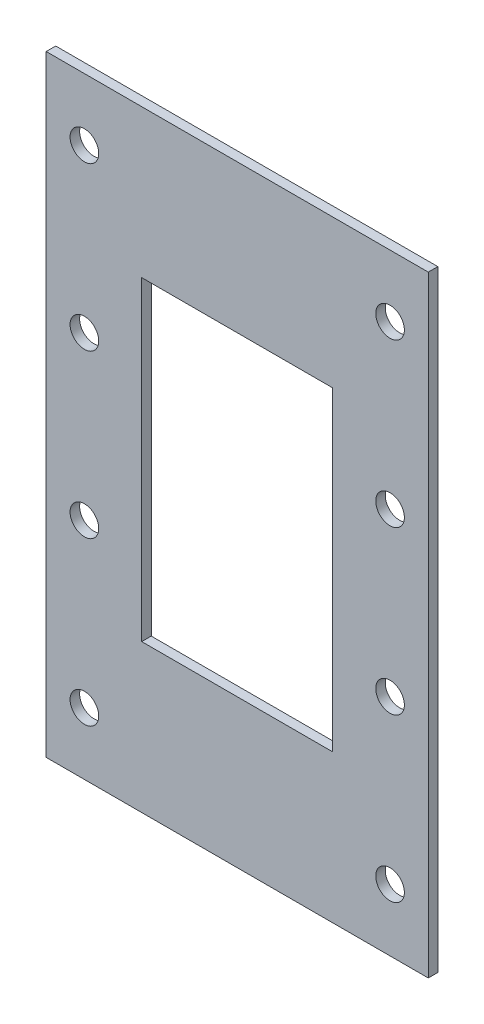
ISO-10303-21;
HEADER;
FILE_DESCRIPTION(('STEP AP214'),'2;1');
FILE_NAME('part.step','',(''),(''),'','','');
FILE_SCHEMA(('AUTOMOTIVE_DESIGN { 1 0 10303 214 1 1 1 1 }'));
ENDSEC;
DATA;
#1=APPLICATION_CONTEXT('core data for automotive mechanical design processes');
#2=APPLICATION_PROTOCOL_DEFINITION('international standard','automotive_design',2000,#1);
#3=PRODUCT_CONTEXT('',#1,'mechanical');
#4=PRODUCT('Part','Part','',(#3));
#5=PRODUCT_RELATED_PRODUCT_CATEGORY('part','',(#4));
#6=PRODUCT_DEFINITION_FORMATION('','',#4);
#7=PRODUCT_DEFINITION_CONTEXT('part definition',#1,'design');
#8=PRODUCT_DEFINITION('design','',#6,#7);
#9=PRODUCT_DEFINITION_SHAPE('','',#8);
#10=(LENGTH_UNIT() NAMED_UNIT(*) SI_UNIT(.MILLI.,.METRE.));
#11=(NAMED_UNIT(*) PLANE_ANGLE_UNIT() SI_UNIT($,.RADIAN.));
#12=(NAMED_UNIT(*) SI_UNIT($,.STERADIAN.) SOLID_ANGLE_UNIT());
#13=UNCERTAINTY_MEASURE_WITH_UNIT(LENGTH_MEASURE(1.E-05),#10,'distance_accuracy_value','');
#14=(GEOMETRIC_REPRESENTATION_CONTEXT(3) GLOBAL_UNCERTAINTY_ASSIGNED_CONTEXT((#13)) GLOBAL_UNIT_ASSIGNED_CONTEXT((#10,
#11,#12)) REPRESENTATION_CONTEXT('',''));
#15=CARTESIAN_POINT('',(0.,0.,0.));
#16=DIRECTION('',(0.,0.,1.));
#17=DIRECTION('',(1.,0.,0.));
#18=AXIS2_PLACEMENT_3D('',#15,#16,#17);
#19=CARTESIAN_POINT('',(0.,0.,1.));
#20=DIRECTION('',(0.,0.,1.));
#21=DIRECTION('',(1.,0.,0.));
#22=AXIS2_PLACEMENT_3D('',#19,#20,#21);
#23=PLANE('',#22);
#24=CARTESIAN_POINT('',(36.,31.3258575197889,1.));
#25=DIRECTION('',(0.,0.,1.));
#26=DIRECTION('',(1.,0.,0.));
#27=AXIS2_PLACEMENT_3D('',#24,#25,#26);
#28=CIRCLE('',#27,1.5);
#29=CARTESIAN_POINT('',(37.5,31.3258575197889,1.));
#30=VERTEX_POINT('',#29);
#31=EDGE_CURVE('E218',#30,#30,#28,.T.);
#32=ORIENTED_EDGE('',*,*,#31,.F.);
#33=EDGE_LOOP('',(#32));
#34=FACE_BOUND('',#33,.T.);
#35=CARTESIAN_POINT('',(36.,14.3258575197889,1.));
#36=DIRECTION('',(0.,0.,1.));
#37=DIRECTION('',(1.,0.,0.));
#38=AXIS2_PLACEMENT_3D('',#35,#36,#37);
#39=CIRCLE('',#38,1.5);
#40=CARTESIAN_POINT('',(37.5,14.3258575197889,1.));
#41=VERTEX_POINT('',#40);
#42=EDGE_CURVE('E214',#41,#41,#39,.T.);
#43=ORIENTED_EDGE('',*,*,#42,.F.);
#44=EDGE_LOOP('',(#43));
#45=FACE_BOUND('',#44,.T.);
#46=CARTESIAN_POINT('',(36.,-2.67414248021108,1.));
#47=DIRECTION('',(0.,0.,1.));
#48=DIRECTION('',(1.,0.,0.));
#49=AXIS2_PLACEMENT_3D('',#46,#47,#48);
#50=CIRCLE('',#49,1.5);
#51=CARTESIAN_POINT('',(37.5,-2.67414248021108,1.));
#52=VERTEX_POINT('',#51);
#53=EDGE_CURVE('E210',#52,#52,#50,.T.);
#54=ORIENTED_EDGE('',*,*,#53,.F.);
#55=EDGE_LOOP('',(#54));
#56=FACE_BOUND('',#55,.T.);
#57=CARTESIAN_POINT('',(36.,-19.6741424802111,1.));
#58=DIRECTION('',(0.,0.,1.));
#59=DIRECTION('',(1.,0.,0.));
#60=AXIS2_PLACEMENT_3D('',#57,#58,#59);
#61=CIRCLE('',#60,1.5);
#62=CARTESIAN_POINT('',(37.5,-19.6741424802111,1.));
#63=VERTEX_POINT('',#62);
#64=EDGE_CURVE('E206',#63,#63,#61,.T.);
#65=ORIENTED_EDGE('',*,*,#64,.F.);
#66=EDGE_LOOP('',(#65));
#67=FACE_BOUND('',#66,.T.);
#68=CARTESIAN_POINT('',(4.00000000000001,-19.6741424802111,1.));
#69=DIRECTION('',(0.,0.,1.));
#70=DIRECTION('',(1.,0.,0.));
#71=AXIS2_PLACEMENT_3D('',#68,#69,#70);
#72=CIRCLE('',#71,1.5);
#73=CARTESIAN_POINT('',(5.50000000000001,-19.6741424802111,1.));
#74=VERTEX_POINT('',#73);
#75=EDGE_CURVE('E202',#74,#74,#72,.T.);
#76=ORIENTED_EDGE('',*,*,#75,.F.);
#77=EDGE_LOOP('',(#76));
#78=FACE_BOUND('',#77,.T.);
#79=CARTESIAN_POINT('',(4.,-2.67414248021108,1.));
#80=DIRECTION('',(0.,0.,1.));
#81=DIRECTION('',(1.,0.,0.));
#82=AXIS2_PLACEMENT_3D('',#79,#80,#81);
#83=CIRCLE('',#82,1.5);
#84=CARTESIAN_POINT('',(5.5,-2.67414248021108,1.));
#85=VERTEX_POINT('',#84);
#86=EDGE_CURVE('E198',#85,#85,#83,.T.);
#87=ORIENTED_EDGE('',*,*,#86,.F.);
#88=EDGE_LOOP('',(#87));
#89=FACE_BOUND('',#88,.T.);
#90=CARTESIAN_POINT('',(4.,14.3258575197889,1.));
#91=DIRECTION('',(0.,0.,1.));
#92=DIRECTION('',(1.,0.,0.));
#93=AXIS2_PLACEMENT_3D('',#90,#91,#92);
#94=CIRCLE('',#93,1.5);
#95=CARTESIAN_POINT('',(5.5,14.3258575197889,1.));
#96=VERTEX_POINT('',#95);
#97=EDGE_CURVE('E194',#96,#96,#94,.T.);
#98=ORIENTED_EDGE('',*,*,#97,.F.);
#99=EDGE_LOOP('',(#98));
#100=FACE_BOUND('',#99,.T.);
#101=CARTESIAN_POINT('',(4.,31.3258575197889,1.));
#102=DIRECTION('',(0.,0.,1.));
#103=DIRECTION('',(1.,0.,0.));
#104=AXIS2_PLACEMENT_3D('',#101,#102,#103);
#105=CIRCLE('',#104,1.5);
#106=CARTESIAN_POINT('',(5.5,31.3258575197889,1.));
#107=VERTEX_POINT('',#106);
#108=EDGE_CURVE('E190',#107,#107,#105,.T.);
#109=ORIENTED_EDGE('',*,*,#108,.F.);
#110=EDGE_LOOP('',(#109));
#111=FACE_BOUND('',#110,.T.);
#112=DIRECTION('',(0.,-1.,0.));
#113=VECTOR('',#112,1.);
#114=CARTESIAN_POINT('',(0.,37.8258575197889,1.));
#115=LINE('',#114,#113);
#116=CARTESIAN_POINT('',(0.,37.8258575197889,1.));
#117=VERTEX_POINT('',#116);
#118=CARTESIAN_POINT('',(0.,-26.1741424802111,1.));
#119=VERTEX_POINT('',#118);
#120=EDGE_CURVE('E223',#117,#119,#115,.T.);
#121=ORIENTED_EDGE('',*,*,#120,.T.);
#122=DIRECTION('',(1.,0.,0.));
#123=VECTOR('',#122,1.);
#124=CARTESIAN_POINT('',(0.,-26.1741424802111,1.));
#125=LINE('',#124,#123);
#126=CARTESIAN_POINT('',(40.,-26.1741424802111,1.));
#127=VERTEX_POINT('',#126);
#128=EDGE_CURVE('E227',#119,#127,#125,.T.);
#129=ORIENTED_EDGE('',*,*,#128,.T.);
#130=DIRECTION('',(0.,1.,0.));
#131=VECTOR('',#130,1.);
#132=CARTESIAN_POINT('',(40.,37.8258575197889,1.));
#133=LINE('',#132,#131);
#134=CARTESIAN_POINT('',(40.,37.8258575197889,1.));
#135=VERTEX_POINT('',#134);
#136=EDGE_CURVE('E231',#127,#135,#133,.T.);
#137=ORIENTED_EDGE('',*,*,#136,.T.);
#138=DIRECTION('',(-1.,0.,0.));
#139=VECTOR('',#138,1.);
#140=CARTESIAN_POINT('',(0.,37.8258575197889,1.));
#141=LINE('',#140,#139);
#142=EDGE_CURVE('E234',#135,#117,#141,.T.);
#143=ORIENTED_EDGE('',*,*,#142,.T.);
#144=EDGE_LOOP('',(#121,#129,#137,#143));
#145=FACE_BOUND('',#144,.T.);
#146=DIRECTION('',(1.,0.,0.));
#147=VECTOR('',#146,1.);
#148=CARTESIAN_POINT('',(0.,22.3258575197889,1.));
#149=LINE('',#148,#147);
#150=CARTESIAN_POINT('',(10.,22.3258575197889,1.));
#151=VERTEX_POINT('',#150);
#152=CARTESIAN_POINT('',(30.,22.3258575197889,1.));
#153=VERTEX_POINT('',#152);
#154=EDGE_CURVE('E173',#151,#153,#149,.T.);
#155=ORIENTED_EDGE('',*,*,#154,.T.);
#156=DIRECTION('',(0.,-1.,0.));
#157=VECTOR('',#156,1.);
#158=CARTESIAN_POINT('',(30.,0.,1.));
#159=LINE('',#158,#157);
#160=CARTESIAN_POINT('',(30.,-10.6741424802111,1.));
#161=VERTEX_POINT('',#160);
#162=EDGE_CURVE('E147',#153,#161,#159,.T.);
#163=ORIENTED_EDGE('',*,*,#162,.T.);
#164=DIRECTION('',(1.,0.,0.));
#165=VECTOR('',#164,1.);
#166=CARTESIAN_POINT('',(0.,-10.6741424802111,1.));
#167=LINE('',#166,#165);
#168=CARTESIAN_POINT('',(10.,-10.6741424802111,1.));
#169=VERTEX_POINT('',#168);
#170=EDGE_CURVE('E185',#169,#161,#167,.T.);
#171=ORIENTED_EDGE('',*,*,#170,.F.);
#172=DIRECTION('',(0.,-1.,0.));
#173=VECTOR('',#172,1.);
#174=CARTESIAN_POINT('',(10.,0.,1.));
#175=LINE('',#174,#173);
#176=EDGE_CURVE('E182',#151,#169,#175,.T.);
#177=ORIENTED_EDGE('',*,*,#176,.F.);
#178=EDGE_LOOP('',(#155,#163,#171,#177));
#179=FACE_BOUND('',#178,.T.);
#180=ADVANCED_FACE('F69',(#34,#45,#56,#67,#78,#89,#100,#111,#145,#179),#23,.T.);
#181=CARTESIAN_POINT('',(0.,0.,0.));
#182=DIRECTION('',(0.,0.,1.));
#183=DIRECTION('',(1.,0.,0.));
#184=AXIS2_PLACEMENT_3D('',#181,#182,#183);
#185=PLANE('',#184);
#186=CARTESIAN_POINT('',(36.,31.3258575197889,0.));
#187=DIRECTION('',(0.,0.,1.));
#188=DIRECTION('',(1.,0.,0.));
#189=AXIS2_PLACEMENT_3D('',#186,#187,#188);
#190=CIRCLE('',#189,1.5);
#191=CARTESIAN_POINT('',(37.5,31.3258575197889,0.));
#192=VERTEX_POINT('',#191);
#193=EDGE_CURVE('E163',#192,#192,#190,.T.);
#194=ORIENTED_EDGE('',*,*,#193,.T.);
#195=EDGE_LOOP('',(#194));
#196=FACE_BOUND('',#195,.T.);
#197=CARTESIAN_POINT('',(36.,14.3258575197889,0.));
#198=DIRECTION('',(0.,0.,1.));
#199=DIRECTION('',(1.,0.,0.));
#200=AXIS2_PLACEMENT_3D('',#197,#198,#199);
#201=CIRCLE('',#200,1.5);
#202=CARTESIAN_POINT('',(37.5,14.3258575197889,0.));
#203=VERTEX_POINT('',#202);
#204=EDGE_CURVE('E355',#203,#203,#201,.T.);
#205=ORIENTED_EDGE('',*,*,#204,.T.);
#206=EDGE_LOOP('',(#205));
#207=FACE_BOUND('',#206,.T.);
#208=CARTESIAN_POINT('',(36.,-2.67414248021108,0.));
#209=DIRECTION('',(0.,0.,1.));
#210=DIRECTION('',(1.,0.,0.));
#211=AXIS2_PLACEMENT_3D('',#208,#209,#210);
#212=CIRCLE('',#211,1.5);
#213=CARTESIAN_POINT('',(37.5,-2.67414248021108,0.));
#214=VERTEX_POINT('',#213);
#215=EDGE_CURVE('E358',#214,#214,#212,.T.);
#216=ORIENTED_EDGE('',*,*,#215,.T.);
#217=EDGE_LOOP('',(#216));
#218=FACE_BOUND('',#217,.T.);
#219=CARTESIAN_POINT('',(36.,-19.6741424802111,0.));
#220=DIRECTION('',(0.,0.,1.));
#221=DIRECTION('',(1.,0.,0.));
#222=AXIS2_PLACEMENT_3D('',#219,#220,#221);
#223=CIRCLE('',#222,1.5);
#224=CARTESIAN_POINT('',(37.5,-19.6741424802111,0.));
#225=VERTEX_POINT('',#224);
#226=EDGE_CURVE('E362',#225,#225,#223,.T.);
#227=ORIENTED_EDGE('',*,*,#226,.T.);
#228=EDGE_LOOP('',(#227));
#229=FACE_BOUND('',#228,.T.);
#230=CARTESIAN_POINT('',(4.00000000000001,-19.6741424802111,0.));
#231=DIRECTION('',(0.,0.,1.));
#232=DIRECTION('',(1.,0.,0.));
#233=AXIS2_PLACEMENT_3D('',#230,#231,#232);
#234=CIRCLE('',#233,1.5);
#235=CARTESIAN_POINT('',(5.50000000000001,-19.6741424802111,0.));
#236=VERTEX_POINT('',#235);
#237=EDGE_CURVE('E369',#236,#236,#234,.T.);
#238=ORIENTED_EDGE('',*,*,#237,.T.);
#239=EDGE_LOOP('',(#238));
#240=FACE_BOUND('',#239,.T.);
#241=CARTESIAN_POINT('',(4.,-2.67414248021108,0.));
#242=DIRECTION('',(0.,0.,1.));
#243=DIRECTION('',(1.,0.,0.));
#244=AXIS2_PLACEMENT_3D('',#241,#242,#243);
#245=CIRCLE('',#244,1.5);
#246=CARTESIAN_POINT('',(5.5,-2.67414248021108,0.));
#247=VERTEX_POINT('',#246);
#248=EDGE_CURVE('E373',#247,#247,#245,.T.);
#249=ORIENTED_EDGE('',*,*,#248,.T.);
#250=EDGE_LOOP('',(#249));
#251=FACE_BOUND('',#250,.T.);
#252=CARTESIAN_POINT('',(4.,14.3258575197889,0.));
#253=DIRECTION('',(0.,0.,1.));
#254=DIRECTION('',(1.,0.,0.));
#255=AXIS2_PLACEMENT_3D('',#252,#253,#254);
#256=CIRCLE('',#255,1.5);
#257=CARTESIAN_POINT('',(5.5,14.3258575197889,0.));
#258=VERTEX_POINT('',#257);
#259=EDGE_CURVE('E160',#258,#258,#256,.T.);
#260=ORIENTED_EDGE('',*,*,#259,.T.);
#261=EDGE_LOOP('',(#260));
#262=FACE_BOUND('',#261,.T.);
#263=CARTESIAN_POINT('',(4.,31.3258575197889,0.));
#264=DIRECTION('',(0.,0.,1.));
#265=DIRECTION('',(1.,0.,0.));
#266=AXIS2_PLACEMENT_3D('',#263,#264,#265);
#267=CIRCLE('',#266,1.5);
#268=CARTESIAN_POINT('',(5.5,31.3258575197889,0.));
#269=VERTEX_POINT('',#268);
#270=EDGE_CURVE('E156',#269,#269,#267,.T.);
#271=ORIENTED_EDGE('',*,*,#270,.T.);
#272=EDGE_LOOP('',(#271));
#273=FACE_BOUND('',#272,.T.);
#274=DIRECTION('',(0.,-1.,0.));
#275=VECTOR('',#274,1.);
#276=CARTESIAN_POINT('',(0.,37.8258575197889,0.));
#277=LINE('',#276,#275);
#278=CARTESIAN_POINT('',(0.,37.8258575197889,0.));
#279=VERTEX_POINT('',#278);
#280=CARTESIAN_POINT('',(0.,-26.1741424802111,0.));
#281=VERTEX_POINT('',#280);
#282=EDGE_CURVE('E222',#279,#281,#277,.T.);
#283=ORIENTED_EDGE('',*,*,#282,.F.);
#284=DIRECTION('',(-1.,0.,0.));
#285=VECTOR('',#284,1.);
#286=CARTESIAN_POINT('',(0.,37.8258575197889,0.));
#287=LINE('',#286,#285);
#288=CARTESIAN_POINT('',(40.,37.8258575197889,0.));
#289=VERTEX_POINT('',#288);
#290=EDGE_CURVE('E228',#289,#279,#287,.T.);
#291=ORIENTED_EDGE('',*,*,#290,.F.);
#292=DIRECTION('',(0.,1.,0.));
#293=VECTOR('',#292,1.);
#294=CARTESIAN_POINT('',(40.,37.8258575197889,0.));
#295=LINE('',#294,#293);
#296=CARTESIAN_POINT('',(40.,-26.1741424802111,0.));
#297=VERTEX_POINT('',#296);
#298=EDGE_CURVE('E244',#297,#289,#295,.T.);
#299=ORIENTED_EDGE('',*,*,#298,.F.);
#300=DIRECTION('',(1.,0.,0.));
#301=VECTOR('',#300,1.);
#302=CARTESIAN_POINT('',(0.,-26.1741424802111,0.));
#303=LINE('',#302,#301);
#304=EDGE_CURVE('E241',#281,#297,#303,.T.);
#305=ORIENTED_EDGE('',*,*,#304,.F.);
#306=EDGE_LOOP('',(#283,#291,#299,#305));
#307=FACE_BOUND('',#306,.T.);
#308=DIRECTION('',(0.,-1.,0.));
#309=VECTOR('',#308,1.);
#310=CARTESIAN_POINT('',(30.,0.,0.));
#311=LINE('',#310,#309);
#312=CARTESIAN_POINT('',(30.,22.3258575197889,0.));
#313=VERTEX_POINT('',#312);
#314=CARTESIAN_POINT('',(30.,-10.6741424802111,0.));
#315=VERTEX_POINT('',#314);
#316=EDGE_CURVE('E140',#313,#315,#311,.T.);
#317=ORIENTED_EDGE('',*,*,#316,.F.);
#318=DIRECTION('',(1.,0.,0.));
#319=VECTOR('',#318,1.);
#320=CARTESIAN_POINT('',(0.,22.3258575197889,0.));
#321=LINE('',#320,#319);
#322=CARTESIAN_POINT('',(10.,22.3258575197889,0.));
#323=VERTEX_POINT('',#322);
#324=EDGE_CURVE('E134',#323,#313,#321,.T.);
#325=ORIENTED_EDGE('',*,*,#324,.F.);
#326=DIRECTION('',(0.,-1.,0.));
#327=VECTOR('',#326,1.);
#328=CARTESIAN_POINT('',(10.,0.,0.));
#329=LINE('',#328,#327);
#330=CARTESIAN_POINT('',(10.,-10.6741424802111,0.));
#331=VERTEX_POINT('',#330);
#332=EDGE_CURVE('E93',#323,#331,#329,.T.);
#333=ORIENTED_EDGE('',*,*,#332,.T.);
#334=DIRECTION('',(1.,0.,0.));
#335=VECTOR('',#334,1.);
#336=CARTESIAN_POINT('',(0.,-10.6741424802111,0.));
#337=LINE('',#336,#335);
#338=EDGE_CURVE('E150',#331,#315,#337,.T.);
#339=ORIENTED_EDGE('',*,*,#338,.T.);
#340=EDGE_LOOP('',(#317,#325,#333,#339));
#341=FACE_BOUND('',#340,.T.);
#342=ADVANCED_FACE('F153',(#196,#207,#218,#229,#240,#251,#262,#273,#307,#341),#185,.F.);
#343=CARTESIAN_POINT('',(0.,37.8258575197889,1.));
#344=DIRECTION('',(1.,0.,0.));
#345=DIRECTION('',(0.,0.,-1.));
#346=AXIS2_PLACEMENT_3D('',#343,#344,#345);
#347=PLANE('',#346);
#348=ORIENTED_EDGE('',*,*,#282,.T.);
#349=DIRECTION('',(0.,0.,-1.));
#350=VECTOR('',#349,1.);
#351=CARTESIAN_POINT('',(0.,-26.1741424802111,1.));
#352=LINE('',#351,#350);
#353=EDGE_CURVE('E12',#119,#281,#352,.T.);
#354=ORIENTED_EDGE('',*,*,#353,.F.);
#355=ORIENTED_EDGE('',*,*,#120,.F.);
#356=DIRECTION('',(0.,0.,-1.));
#357=VECTOR('',#356,1.);
#358=CARTESIAN_POINT('',(0.,37.8258575197889,1.));
#359=LINE('',#358,#357);
#360=EDGE_CURVE('E237',#117,#279,#359,.T.);
#361=ORIENTED_EDGE('',*,*,#360,.T.);
#362=EDGE_LOOP('',(#348,#354,#355,#361));
#363=FACE_BOUND('',#362,.T.);
#364=ADVANCED_FACE('F71',(#363),#347,.F.);
#365=CARTESIAN_POINT('',(0.,-26.1741424802111,1.));
#366=DIRECTION('',(0.,1.,0.));
#367=DIRECTION('',(0.,0.,1.));
#368=AXIS2_PLACEMENT_3D('',#365,#366,#367);
#369=PLANE('',#368);
#370=ORIENTED_EDGE('',*,*,#304,.T.);
#371=DIRECTION('',(0.,0.,-1.));
#372=VECTOR('',#371,1.);
#373=CARTESIAN_POINT('',(40.,-26.1741424802111,1.));
#374=LINE('',#373,#372);
#375=EDGE_CURVE('E78',#127,#297,#374,.T.);
#376=ORIENTED_EDGE('',*,*,#375,.F.);
#377=ORIENTED_EDGE('',*,*,#128,.F.);
#378=ORIENTED_EDGE('',*,*,#353,.T.);
#379=EDGE_LOOP('',(#370,#376,#377,#378));
#380=FACE_BOUND('',#379,.T.);
#381=ADVANCED_FACE('F276',(#380),#369,.F.);
#382=CARTESIAN_POINT('',(40.,37.8258575197889,1.));
#383=DIRECTION('',(-1.,0.,0.));
#384=DIRECTION('',(0.,-1.,0.));
#385=AXIS2_PLACEMENT_3D('',#382,#383,#384);
#386=PLANE('',#385);
#387=ORIENTED_EDGE('',*,*,#298,.T.);
#388=DIRECTION('',(0.,0.,-1.));
#389=VECTOR('',#388,1.);
#390=CARTESIAN_POINT('',(40.,37.8258575197889,1.));
#391=LINE('',#390,#389);
#392=EDGE_CURVE('E252',#135,#289,#391,.T.);
#393=ORIENTED_EDGE('',*,*,#392,.F.);
#394=ORIENTED_EDGE('',*,*,#136,.F.);
#395=ORIENTED_EDGE('',*,*,#375,.T.);
#396=EDGE_LOOP('',(#387,#393,#394,#395));
#397=FACE_BOUND('',#396,.T.);
#398=ADVANCED_FACE('F261',(#397),#386,.F.);
#399=CARTESIAN_POINT('',(0.,37.8258575197889,1.));
#400=DIRECTION('',(0.,-1.,0.));
#401=DIRECTION('',(0.,0.,-1.));
#402=AXIS2_PLACEMENT_3D('',#399,#400,#401);
#403=PLANE('',#402);
#404=ORIENTED_EDGE('',*,*,#290,.T.);
#405=ORIENTED_EDGE('',*,*,#360,.F.);
#406=ORIENTED_EDGE('',*,*,#142,.F.);
#407=ORIENTED_EDGE('',*,*,#392,.T.);
#408=EDGE_LOOP('',(#404,#405,#406,#407));
#409=FACE_BOUND('',#408,.T.);
#410=ADVANCED_FACE('F269',(#409),#403,.F.);
#411=CARTESIAN_POINT('',(30.,0.,0.));
#412=DIRECTION('',(-1.,0.,0.));
#413=DIRECTION('',(0.,-1.,0.));
#414=AXIS2_PLACEMENT_3D('',#411,#412,#413);
#415=PLANE('',#414);
#416=DIRECTION('',(0.,0.,1.));
#417=VECTOR('',#416,1.);
#418=CARTESIAN_POINT('',(30.,22.3258575197889,0.));
#419=LINE('',#418,#417);
#420=EDGE_CURVE('E85',#313,#153,#419,.T.);
#421=ORIENTED_EDGE('',*,*,#420,.F.);
#422=ORIENTED_EDGE('',*,*,#316,.T.);
#423=DIRECTION('',(0.,0.,1.));
#424=VECTOR('',#423,1.);
#425=CARTESIAN_POINT('',(30.,-10.6741424802111,0.));
#426=LINE('',#425,#424);
#427=EDGE_CURVE('E170',#315,#161,#426,.T.);
#428=ORIENTED_EDGE('',*,*,#427,.T.);
#429=ORIENTED_EDGE('',*,*,#162,.F.);
#430=EDGE_LOOP('',(#421,#422,#428,#429));
#431=FACE_BOUND('',#430,.T.);
#432=ADVANCED_FACE('F143',(#431),#415,.T.);
#433=CARTESIAN_POINT('',(0.,-10.6741424802111,0.));
#434=DIRECTION('',(0.,-1.,0.));
#435=DIRECTION('',(1.,0.,0.));
#436=AXIS2_PLACEMENT_3D('',#433,#434,#435);
#437=PLANE('',#436);
#438=ORIENTED_EDGE('',*,*,#170,.T.);
#439=ORIENTED_EDGE('',*,*,#427,.F.);
#440=ORIENTED_EDGE('',*,*,#338,.F.);
#441=DIRECTION('',(0.,0.,1.));
#442=VECTOR('',#441,1.);
#443=CARTESIAN_POINT('',(10.,-10.6741424802111,0.));
#444=LINE('',#443,#442);
#445=EDGE_CURVE('E174',#331,#169,#444,.T.);
#446=ORIENTED_EDGE('',*,*,#445,.T.);
#447=EDGE_LOOP('',(#438,#439,#440,#446));
#448=FACE_BOUND('',#447,.T.);
#449=ADVANCED_FACE('F300',(#448),#437,.F.);
#450=CARTESIAN_POINT('',(10.,0.,0.));
#451=DIRECTION('',(-1.,0.,0.));
#452=DIRECTION('',(0.,-1.,0.));
#453=AXIS2_PLACEMENT_3D('',#450,#451,#452);
#454=PLANE('',#453);
#455=ORIENTED_EDGE('',*,*,#176,.T.);
#456=ORIENTED_EDGE('',*,*,#445,.F.);
#457=ORIENTED_EDGE('',*,*,#332,.F.);
#458=DIRECTION('',(0.,0.,1.));
#459=VECTOR('',#458,1.);
#460=CARTESIAN_POINT('',(10.,22.3258575197889,0.));
#461=LINE('',#460,#459);
#462=EDGE_CURVE('E136',#323,#151,#461,.T.);
#463=ORIENTED_EDGE('',*,*,#462,.T.);
#464=EDGE_LOOP('',(#455,#456,#457,#463));
#465=FACE_BOUND('',#464,.T.);
#466=ADVANCED_FACE('F304',(#465),#454,.F.);
#467=CARTESIAN_POINT('',(0.,22.3258575197889,0.));
#468=DIRECTION('',(0.,-1.,0.));
#469=DIRECTION('',(1.,0.,0.));
#470=AXIS2_PLACEMENT_3D('',#467,#468,#469);
#471=PLANE('',#470);
#472=ORIENTED_EDGE('',*,*,#462,.F.);
#473=ORIENTED_EDGE('',*,*,#324,.T.);
#474=ORIENTED_EDGE('',*,*,#420,.T.);
#475=ORIENTED_EDGE('',*,*,#154,.F.);
#476=EDGE_LOOP('',(#472,#473,#474,#475));
#477=FACE_BOUND('',#476,.T.);
#478=ADVANCED_FACE('F135',(#477),#471,.T.);
#479=CARTESIAN_POINT('',(4.,31.3258575197889,0.));
#480=DIRECTION('',(0.,0.,1.));
#481=DIRECTION('',(1.,0.,0.));
#482=AXIS2_PLACEMENT_3D('',#479,#480,#481);
#483=CYLINDRICAL_SURFACE('',#482,1.5);
#484=ORIENTED_EDGE('',*,*,#108,.T.);
#485=EDGE_LOOP('',(#484));
#486=FACE_BOUND('',#485,.T.);
#487=ORIENTED_EDGE('',*,*,#270,.F.);
#488=EDGE_LOOP('',(#487));
#489=FACE_BOUND('',#488,.T.);
#490=ADVANCED_FACE('F315',(#486,#489),#483,.F.);
#491=CARTESIAN_POINT('',(4.,14.3258575197889,0.));
#492=DIRECTION('',(0.,0.,1.));
#493=DIRECTION('',(1.,0.,0.));
#494=AXIS2_PLACEMENT_3D('',#491,#492,#493);
#495=CYLINDRICAL_SURFACE('',#494,1.5);
#496=ORIENTED_EDGE('',*,*,#97,.T.);
#497=EDGE_LOOP('',(#496));
#498=FACE_BOUND('',#497,.T.);
#499=ORIENTED_EDGE('',*,*,#259,.F.);
#500=EDGE_LOOP('',(#499));
#501=FACE_BOUND('',#500,.T.);
#502=ADVANCED_FACE('F319',(#498,#501),#495,.F.);
#503=CARTESIAN_POINT('',(4.,-2.67414248021108,0.));
#504=DIRECTION('',(0.,0.,1.));
#505=DIRECTION('',(1.,0.,0.));
#506=AXIS2_PLACEMENT_3D('',#503,#504,#505);
#507=CYLINDRICAL_SURFACE('',#506,1.5);
#508=ORIENTED_EDGE('',*,*,#86,.T.);
#509=EDGE_LOOP('',(#508));
#510=FACE_BOUND('',#509,.T.);
#511=ORIENTED_EDGE('',*,*,#248,.F.);
#512=EDGE_LOOP('',(#511));
#513=FACE_BOUND('',#512,.T.);
#514=ADVANCED_FACE('F325',(#510,#513),#507,.F.);
#515=CARTESIAN_POINT('',(4.00000000000001,-19.6741424802111,0.));
#516=DIRECTION('',(0.,0.,1.));
#517=DIRECTION('',(1.,0.,0.));
#518=AXIS2_PLACEMENT_3D('',#515,#516,#517);
#519=CYLINDRICAL_SURFACE('',#518,1.5);
#520=ORIENTED_EDGE('',*,*,#75,.T.);
#521=EDGE_LOOP('',(#520));
#522=FACE_BOUND('',#521,.T.);
#523=ORIENTED_EDGE('',*,*,#237,.F.);
#524=EDGE_LOOP('',(#523));
#525=FACE_BOUND('',#524,.T.);
#526=ADVANCED_FACE('F332',(#522,#525),#519,.F.);
#527=CARTESIAN_POINT('',(36.,-19.6741424802111,0.));
#528=DIRECTION('',(0.,0.,1.));
#529=DIRECTION('',(1.,0.,0.));
#530=AXIS2_PLACEMENT_3D('',#527,#528,#529);
#531=CYLINDRICAL_SURFACE('',#530,1.5);
#532=ORIENTED_EDGE('',*,*,#64,.T.);
#533=EDGE_LOOP('',(#532));
#534=FACE_BOUND('',#533,.T.);
#535=ORIENTED_EDGE('',*,*,#226,.F.);
#536=EDGE_LOOP('',(#535));
#537=FACE_BOUND('',#536,.T.);
#538=ADVANCED_FACE('F336',(#534,#537),#531,.F.);
#539=CARTESIAN_POINT('',(36.,-2.67414248021108,0.));
#540=DIRECTION('',(0.,0.,1.));
#541=DIRECTION('',(1.,0.,0.));
#542=AXIS2_PLACEMENT_3D('',#539,#540,#541);
#543=CYLINDRICAL_SURFACE('',#542,1.5);
#544=ORIENTED_EDGE('',*,*,#53,.T.);
#545=EDGE_LOOP('',(#544));
#546=FACE_BOUND('',#545,.T.);
#547=ORIENTED_EDGE('',*,*,#215,.F.);
#548=EDGE_LOOP('',(#547));
#549=FACE_BOUND('',#548,.T.);
#550=ADVANCED_FACE('F340',(#546,#549),#543,.F.);
#551=CARTESIAN_POINT('',(36.,14.3258575197889,0.));
#552=DIRECTION('',(0.,0.,1.));
#553=DIRECTION('',(1.,0.,0.));
#554=AXIS2_PLACEMENT_3D('',#551,#552,#553);
#555=CYLINDRICAL_SURFACE('',#554,1.5);
#556=ORIENTED_EDGE('',*,*,#42,.T.);
#557=EDGE_LOOP('',(#556));
#558=FACE_BOUND('',#557,.T.);
#559=ORIENTED_EDGE('',*,*,#204,.F.);
#560=EDGE_LOOP('',(#559));
#561=FACE_BOUND('',#560,.T.);
#562=ADVANCED_FACE('F343',(#558,#561),#555,.F.);
#563=CARTESIAN_POINT('',(36.,31.3258575197889,0.));
#564=DIRECTION('',(0.,0.,1.));
#565=DIRECTION('',(1.,0.,0.));
#566=AXIS2_PLACEMENT_3D('',#563,#564,#565);
#567=CYLINDRICAL_SURFACE('',#566,1.5);
#568=ORIENTED_EDGE('',*,*,#31,.T.);
#569=EDGE_LOOP('',(#568));
#570=FACE_BOUND('',#569,.T.);
#571=ORIENTED_EDGE('',*,*,#193,.F.);
#572=EDGE_LOOP('',(#571));
#573=FACE_BOUND('',#572,.T.);
#574=ADVANCED_FACE('F312',(#570,#573),#567,.F.);
#575=CLOSED_SHELL('',(#180,#342,#364,#381,#398,#410,#432,#449,#466,#478,#490,#502,#514,#526,
#538,#550,#562,#574));
#576=MANIFOLD_SOLID_BREP('B2',#575);
#577=ADVANCED_BREP_SHAPE_REPRESENTATION('',(#18,#576),#14);
#578=SHAPE_DEFINITION_REPRESENTATION(#9,#577);
ENDSEC;
END-ISO-10303-21;
